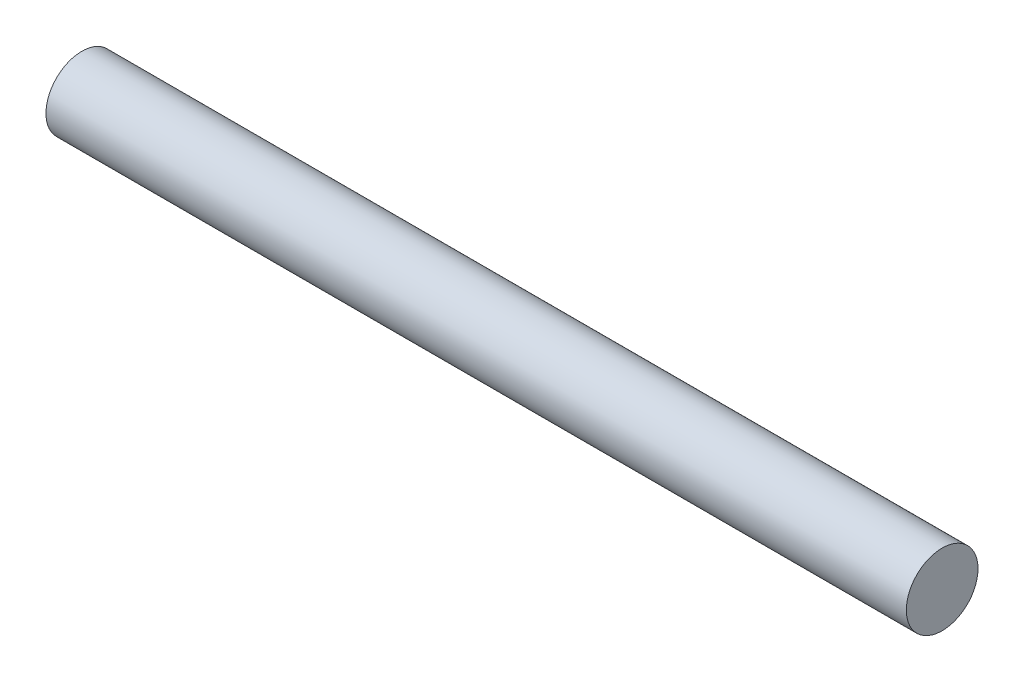
ISO-10303-21;
HEADER;
FILE_DESCRIPTION(('STEP AP214'),'2;1');
FILE_NAME('part.step','',(''),(''),'','','');
FILE_SCHEMA(('AUTOMOTIVE_DESIGN { 1 0 10303 214 1 1 1 1 }'));
ENDSEC;
DATA;
#1=APPLICATION_CONTEXT('core data for automotive mechanical design processes');
#2=APPLICATION_PROTOCOL_DEFINITION('international standard','automotive_design',2000,#1);
#3=PRODUCT_CONTEXT('',#1,'mechanical');
#4=PRODUCT('Part','Part','',(#3));
#5=PRODUCT_RELATED_PRODUCT_CATEGORY('part','',(#4));
#6=PRODUCT_DEFINITION_FORMATION('','',#4);
#7=PRODUCT_DEFINITION_CONTEXT('part definition',#1,'design');
#8=PRODUCT_DEFINITION('design','',#6,#7);
#9=PRODUCT_DEFINITION_SHAPE('','',#8);
#10=(LENGTH_UNIT() NAMED_UNIT(*) SI_UNIT(.MILLI.,.METRE.));
#11=(NAMED_UNIT(*) PLANE_ANGLE_UNIT() SI_UNIT($,.RADIAN.));
#12=(NAMED_UNIT(*) SI_UNIT($,.STERADIAN.) SOLID_ANGLE_UNIT());
#13=UNCERTAINTY_MEASURE_WITH_UNIT(LENGTH_MEASURE(1.E-05),#10,'distance_accuracy_value','');
#14=(GEOMETRIC_REPRESENTATION_CONTEXT(3) GLOBAL_UNCERTAINTY_ASSIGNED_CONTEXT((#13)) GLOBAL_UNIT_ASSIGNED_CONTEXT((#10,
#11,#12)) REPRESENTATION_CONTEXT('',''));
#15=CARTESIAN_POINT('',(0.,0.,0.));
#16=DIRECTION('',(0.,0.,1.));
#17=DIRECTION('',(1.,0.,0.));
#18=AXIS2_PLACEMENT_3D('',#15,#16,#17);
#19=CARTESIAN_POINT('',(38.1,0.,0.));
#20=DIRECTION('',(-1.,0.,0.));
#21=DIRECTION('',(0.,0.,1.));
#22=AXIS2_PLACEMENT_3D('',#19,#20,#21);
#23=CYLINDRICAL_SURFACE('',#22,1.5875);
#24=CARTESIAN_POINT('',(38.1,0.,0.));
#25=DIRECTION('',(1.,0.,0.));
#26=DIRECTION('',(0.,0.,-1.));
#27=AXIS2_PLACEMENT_3D('',#24,#25,#26);
#28=CIRCLE('',#27,1.5875);
#29=CARTESIAN_POINT('',(38.1,0.,-1.5875));
#30=VERTEX_POINT('',#29);
#31=EDGE_CURVE('E10',#30,#30,#28,.T.);
#32=ORIENTED_EDGE('',*,*,#31,.F.);
#33=EDGE_LOOP('',(#32));
#34=FACE_BOUND('',#33,.T.);
#35=CARTESIAN_POINT('',(0.,0.,0.));
#36=DIRECTION('',(1.,0.,0.));
#37=DIRECTION('',(0.,0.,-1.));
#38=AXIS2_PLACEMENT_3D('',#35,#36,#37);
#39=CIRCLE('',#38,1.5875);
#40=CARTESIAN_POINT('',(0.,0.,-1.5875));
#41=VERTEX_POINT('',#40);
#42=EDGE_CURVE('E35',#41,#41,#39,.T.);
#43=ORIENTED_EDGE('',*,*,#42,.T.);
#44=EDGE_LOOP('',(#43));
#45=FACE_BOUND('',#44,.T.);
#46=ADVANCED_FACE('F32',(#34,#45),#23,.T.);
#47=CARTESIAN_POINT('',(38.1,0.,0.));
#48=DIRECTION('',(1.,0.,0.));
#49=DIRECTION('',(0.,0.,-1.));
#50=AXIS2_PLACEMENT_3D('',#47,#48,#49);
#51=PLANE('',#50);
#52=ORIENTED_EDGE('',*,*,#31,.T.);
#53=EDGE_LOOP('',(#52));
#54=FACE_BOUND('',#53,.T.);
#55=ADVANCED_FACE('F47',(#54),#51,.T.);
#56=CARTESIAN_POINT('',(0.,0.,0.));
#57=DIRECTION('',(1.,0.,0.));
#58=DIRECTION('',(0.,0.,-1.));
#59=AXIS2_PLACEMENT_3D('',#56,#57,#58);
#60=PLANE('',#59);
#61=ORIENTED_EDGE('',*,*,#42,.F.);
#62=EDGE_LOOP('',(#61));
#63=FACE_BOUND('',#62,.T.);
#64=ADVANCED_FACE('F45',(#63),#60,.F.);
#65=CLOSED_SHELL('',(#46,#55,#64));
#66=MANIFOLD_SOLID_BREP('B2',#65);
#67=ADVANCED_BREP_SHAPE_REPRESENTATION('',(#18,#66),#14);
#68=SHAPE_DEFINITION_REPRESENTATION(#9,#67);
ENDSEC;
END-ISO-10303-21;
